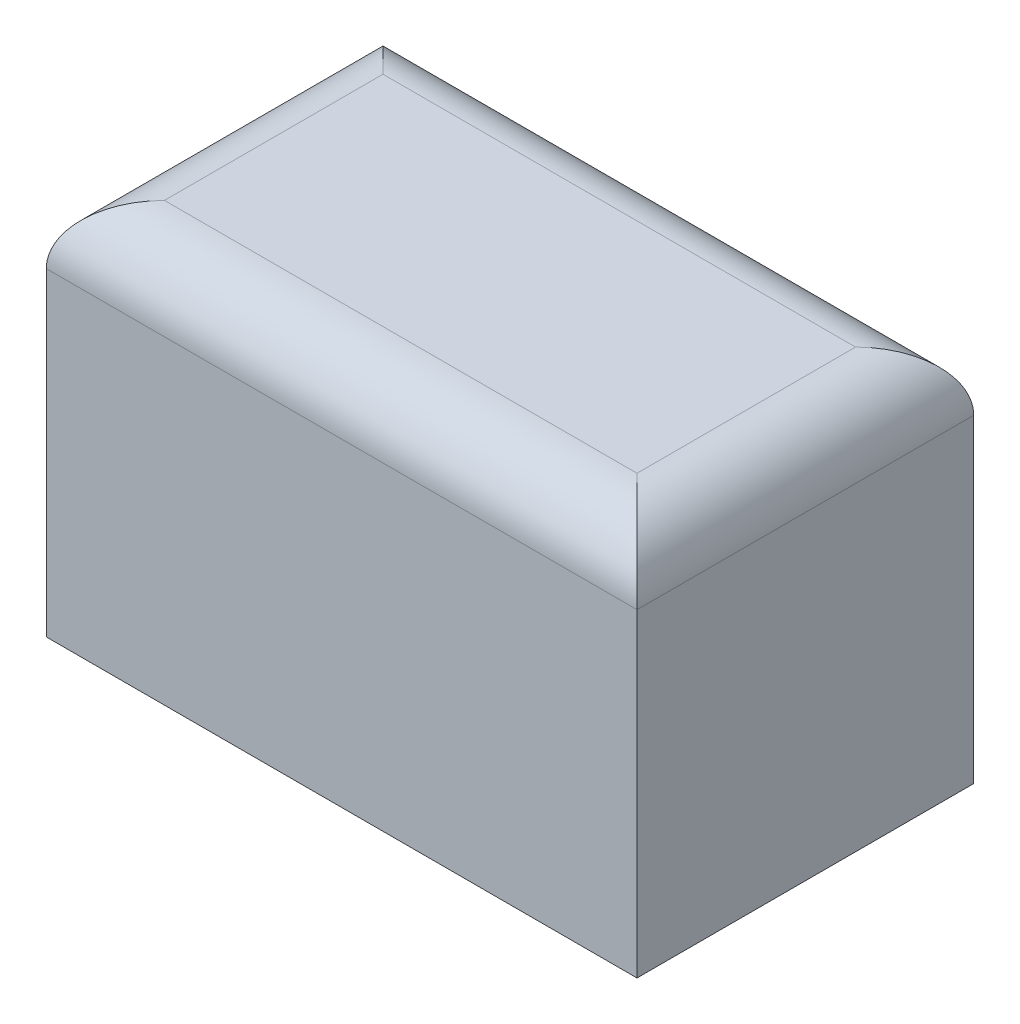
ISO-10303-21;
HEADER;
FILE_DESCRIPTION(('STEP AP214'),'2;1');
FILE_NAME('part.step','',(''),(''),'','','');
FILE_SCHEMA(('AUTOMOTIVE_DESIGN { 1 0 10303 214 1 1 1 1 }'));
ENDSEC;
DATA;
#1=APPLICATION_CONTEXT('core data for automotive mechanical design processes');
#2=APPLICATION_PROTOCOL_DEFINITION('international standard','automotive_design',2000,#1);
#3=PRODUCT_CONTEXT('',#1,'mechanical');
#4=PRODUCT('Part','Part','',(#3));
#5=PRODUCT_RELATED_PRODUCT_CATEGORY('part','',(#4));
#6=PRODUCT_DEFINITION_FORMATION('','',#4);
#7=PRODUCT_DEFINITION_CONTEXT('part definition',#1,'design');
#8=PRODUCT_DEFINITION('design','',#6,#7);
#9=PRODUCT_DEFINITION_SHAPE('','',#8);
#10=(LENGTH_UNIT() NAMED_UNIT(*) SI_UNIT(.MILLI.,.METRE.));
#11=(NAMED_UNIT(*) PLANE_ANGLE_UNIT() SI_UNIT($,.RADIAN.));
#12=(NAMED_UNIT(*) SI_UNIT($,.STERADIAN.) SOLID_ANGLE_UNIT());
#13=UNCERTAINTY_MEASURE_WITH_UNIT(LENGTH_MEASURE(1.E-05),#10,'distance_accuracy_value','');
#14=(GEOMETRIC_REPRESENTATION_CONTEXT(3) GLOBAL_UNCERTAINTY_ASSIGNED_CONTEXT((#13)) GLOBAL_UNIT_ASSIGNED_CONTEXT((#10,
#11,#12)) REPRESENTATION_CONTEXT('',''));
#15=CARTESIAN_POINT('',(0.,0.,0.));
#16=DIRECTION('',(0.,0.,1.));
#17=DIRECTION('',(1.,0.,0.));
#18=AXIS2_PLACEMENT_3D('',#15,#16,#17);
#19=CARTESIAN_POINT('',(5.00000000000002,6.4,2.85000000000001));
#20=DIRECTION('',(-1.,0.,0.));
#21=DIRECTION('',(0.,0.,1.));
#22=AXIS2_PLACEMENT_3D('',#19,#20,#21);
#23=PLANE('',#22);
#24=DIRECTION('',(0.,-1.,0.));
#25=VECTOR('',#24,1.);
#26=CARTESIAN_POINT('',(5.00000000000002,6.4,-2.85000000000001));
#27=LINE('',#26,#25);
#28=CARTESIAN_POINT('',(5.00000000000002,5.4,-2.85000000000001));
#29=VERTEX_POINT('',#28);
#30=CARTESIAN_POINT('',(5.00000000000002,0.,-2.85000000000001));
#31=VERTEX_POINT('',#30);
#32=EDGE_CURVE('E84',#29,#31,#27,.T.);
#33=ORIENTED_EDGE('',*,*,#32,.F.);
#34=DIRECTION('',(0.,0.,-1.));
#35=VECTOR('',#34,1.);
#36=CARTESIAN_POINT('',(5.00000000000002,5.4,2.85000000000001));
#37=LINE('',#36,#35);
#38=CARTESIAN_POINT('',(5.00000000000002,5.4,2.85000000000001));
#39=VERTEX_POINT('',#38);
#40=EDGE_CURVE('E41',#29,#39,#37,.F.);
#41=ORIENTED_EDGE('',*,*,#40,.T.);
#42=DIRECTION('',(0.,-1.,0.));
#43=VECTOR('',#42,1.);
#44=CARTESIAN_POINT('',(5.00000000000002,6.4,2.85000000000001));
#45=LINE('',#44,#43);
#46=CARTESIAN_POINT('',(5.00000000000002,0.,2.85000000000001));
#47=VERTEX_POINT('',#46);
#48=EDGE_CURVE('E101',#39,#47,#45,.T.);
#49=ORIENTED_EDGE('',*,*,#48,.T.);
#50=DIRECTION('',(0.,0.,-1.));
#51=VECTOR('',#50,1.);
#52=CARTESIAN_POINT('',(5.00000000000002,0.,2.85000000000001));
#53=LINE('',#52,#51);
#54=EDGE_CURVE('E97',#47,#31,#53,.T.);
#55=ORIENTED_EDGE('',*,*,#54,.T.);
#56=EDGE_LOOP('',(#33,#41,#49,#55));
#57=FACE_BOUND('',#56,.T.);
#58=ADVANCED_FACE('F32',(#57),#23,.F.);
#59=CARTESIAN_POINT('',(-5.,6.4,-2.85000000000001));
#60=DIRECTION('',(0.,0.,1.));
#61=DIRECTION('',(1.,0.,0.));
#62=AXIS2_PLACEMENT_3D('',#59,#60,#61);
#63=PLANE('',#62);
#64=DIRECTION('',(0.,-1.,0.));
#65=VECTOR('',#64,1.);
#66=CARTESIAN_POINT('',(-5.,6.4,-2.85000000000001));
#67=LINE('',#66,#65);
#68=CARTESIAN_POINT('',(-5.,5.4,-2.85000000000001));
#69=VERTEX_POINT('',#68);
#70=CARTESIAN_POINT('',(-5.,0.,-2.85000000000001));
#71=VERTEX_POINT('',#70);
#72=EDGE_CURVE('E91',#69,#71,#67,.T.);
#73=ORIENTED_EDGE('',*,*,#72,.F.);
#74=DIRECTION('',(-1.,0.,0.));
#75=VECTOR('',#74,1.);
#76=CARTESIAN_POINT('',(-5.,5.4,-2.85000000000001));
#77=LINE('',#76,#75);
#78=EDGE_CURVE('E56',#69,#29,#77,.F.);
#79=ORIENTED_EDGE('',*,*,#78,.T.);
#80=ORIENTED_EDGE('',*,*,#32,.T.);
#81=DIRECTION('',(-1.,0.,0.));
#82=VECTOR('',#81,1.);
#83=CARTESIAN_POINT('',(-5.,0.,-2.85000000000001));
#84=LINE('',#83,#82);
#85=EDGE_CURVE('E87',#31,#71,#84,.T.);
#86=ORIENTED_EDGE('',*,*,#85,.T.);
#87=EDGE_LOOP('',(#73,#79,#80,#86));
#88=FACE_BOUND('',#87,.T.);
#89=ADVANCED_FACE('F86',(#88),#63,.F.);
#90=CARTESIAN_POINT('',(-5.00000000000002,6.4,2.85000000000001));
#91=DIRECTION('',(1.,0.,0.));
#92=DIRECTION('',(0.,0.,-1.));
#93=AXIS2_PLACEMENT_3D('',#90,#91,#92);
#94=PLANE('',#93);
#95=DIRECTION('',(0.,-1.,0.));
#96=VECTOR('',#95,1.);
#97=CARTESIAN_POINT('',(-5.00000000000002,6.4,2.85000000000001));
#98=LINE('',#97,#96);
#99=CARTESIAN_POINT('',(-5.00000000000002,5.4,2.85000000000001));
#100=VERTEX_POINT('',#99);
#101=CARTESIAN_POINT('',(-5.00000000000002,0.,2.85000000000001));
#102=VERTEX_POINT('',#101);
#103=EDGE_CURVE('E111',#100,#102,#98,.T.);
#104=ORIENTED_EDGE('',*,*,#103,.F.);
#105=DIRECTION('',(0.,0.,1.));
#106=VECTOR('',#105,1.);
#107=CARTESIAN_POINT('',(-5.00000000000002,5.4,2.85000000000001));
#108=LINE('',#107,#106);
#109=EDGE_CURVE('E122',#100,#69,#108,.F.);
#110=ORIENTED_EDGE('',*,*,#109,.T.);
#111=ORIENTED_EDGE('',*,*,#72,.T.);
#112=DIRECTION('',(0.,0.,1.));
#113=VECTOR('',#112,1.);
#114=CARTESIAN_POINT('',(-5.00000000000002,0.,2.85000000000001));
#115=LINE('',#114,#113);
#116=EDGE_CURVE('E99',#71,#102,#115,.T.);
#117=ORIENTED_EDGE('',*,*,#116,.T.);
#118=EDGE_LOOP('',(#104,#110,#111,#117));
#119=FACE_BOUND('',#118,.T.);
#120=ADVANCED_FACE('F150',(#119),#94,.F.);
#121=CARTESIAN_POINT('',(-5.00000000000002,6.4,2.85000000000001));
#122=DIRECTION('',(0.,0.,-1.));
#123=DIRECTION('',(-1.,0.,0.));
#124=AXIS2_PLACEMENT_3D('',#121,#122,#123);
#125=PLANE('',#124);
#126=ORIENTED_EDGE('',*,*,#48,.F.);
#127=DIRECTION('',(1.,0.,0.));
#128=VECTOR('',#127,1.);
#129=CARTESIAN_POINT('',(-5.00000000000002,5.4,2.85000000000001));
#130=LINE('',#129,#128);
#131=EDGE_CURVE('E11',#39,#100,#130,.F.);
#132=ORIENTED_EDGE('',*,*,#131,.T.);
#133=ORIENTED_EDGE('',*,*,#103,.T.);
#134=DIRECTION('',(1.,0.,0.));
#135=VECTOR('',#134,1.);
#136=CARTESIAN_POINT('',(-5.00000000000002,0.,2.85000000000001));
#137=LINE('',#136,#135);
#138=EDGE_CURVE('E108',#102,#47,#137,.T.);
#139=ORIENTED_EDGE('',*,*,#138,.T.);
#140=EDGE_LOOP('',(#126,#132,#133,#139));
#141=FACE_BOUND('',#140,.T.);
#142=ADVANCED_FACE('F152',(#141),#125,.F.);
#143=CARTESIAN_POINT('',(0.,6.4,0.));
#144=DIRECTION('',(0.,-1.,0.));
#145=DIRECTION('',(0.,0.,-1.));
#146=AXIS2_PLACEMENT_3D('',#143,#144,#145);
#147=PLANE('',#146);
#148=DIRECTION('',(-1.,0.,0.));
#149=VECTOR('',#148,1.);
#150=CARTESIAN_POINT('',(0.,6.4,-1.85));
#151=LINE('',#150,#149);
#152=CARTESIAN_POINT('',(4.00000000000001,6.4,-1.85));
#153=VERTEX_POINT('',#152);
#154=CARTESIAN_POINT('',(-4.,6.4,-1.85));
#155=VERTEX_POINT('',#154);
#156=EDGE_CURVE('E117',#153,#155,#151,.T.);
#157=ORIENTED_EDGE('',*,*,#156,.T.);
#158=DIRECTION('',(0.,0.,1.));
#159=VECTOR('',#158,1.);
#160=CARTESIAN_POINT('',(-4.,6.4,0.));
#161=LINE('',#160,#159);
#162=CARTESIAN_POINT('',(-4.,6.4,1.85));
#163=VERTEX_POINT('',#162);
#164=EDGE_CURVE('E119',#155,#163,#161,.T.);
#165=ORIENTED_EDGE('',*,*,#164,.T.);
#166=DIRECTION('',(1.,0.,0.));
#167=VECTOR('',#166,1.);
#168=CARTESIAN_POINT('',(0.,6.4,1.85));
#169=LINE('',#168,#167);
#170=CARTESIAN_POINT('',(4.00000000000001,6.4,1.85));
#171=VERTEX_POINT('',#170);
#172=EDGE_CURVE('E90',#163,#171,#169,.T.);
#173=ORIENTED_EDGE('',*,*,#172,.T.);
#174=DIRECTION('',(0.,0.,-1.));
#175=VECTOR('',#174,1.);
#176=CARTESIAN_POINT('',(4.00000000000001,6.4,0.));
#177=LINE('',#176,#175);
#178=EDGE_CURVE('E115',#171,#153,#177,.T.);
#179=ORIENTED_EDGE('',*,*,#178,.T.);
#180=EDGE_LOOP('',(#157,#165,#173,#179));
#181=FACE_BOUND('',#180,.T.);
#182=ADVANCED_FACE('F142',(#181),#147,.F.);
#183=CARTESIAN_POINT('',(0.,0.,0.));
#184=DIRECTION('',(0.,-1.,0.));
#185=DIRECTION('',(0.,0.,-1.));
#186=AXIS2_PLACEMENT_3D('',#183,#184,#185);
#187=PLANE('',#186);
#188=ORIENTED_EDGE('',*,*,#54,.F.);
#189=ORIENTED_EDGE('',*,*,#138,.F.);
#190=ORIENTED_EDGE('',*,*,#116,.F.);
#191=ORIENTED_EDGE('',*,*,#85,.F.);
#192=EDGE_LOOP('',(#188,#189,#190,#191));
#193=FACE_BOUND('',#192,.T.);
#194=ADVANCED_FACE('F95',(#193),#187,.T.);
#195=CARTESIAN_POINT('',(4.00000000000001,5.4,0.));
#196=DIRECTION('',(0.,0.,-1.));
#197=DIRECTION('',(-1.,0.,0.));
#198=AXIS2_PLACEMENT_3D('',#195,#196,#197);
#199=CYLINDRICAL_SURFACE('',#198,1.);
#200=CARTESIAN_POINT('',(4.00000000000001,5.4,1.85));
#201=DIRECTION('',(0.707106781186549,0.,-0.707106781186549));
#202=DIRECTION('',(0.707106781186549,0.,0.707106781186549));
#203=AXIS2_PLACEMENT_3D('',#200,#201,#202);
#204=ELLIPSE('',#203,1.41421356237309,1.);
#205=EDGE_CURVE('E105',#39,#171,#204,.F.);
#206=ORIENTED_EDGE('',*,*,#205,.F.);
#207=ORIENTED_EDGE('',*,*,#40,.F.);
#208=CARTESIAN_POINT('',(4.00000000000001,5.4,-1.85));
#209=DIRECTION('',(-0.707106781186549,0.,-0.707106781186549));
#210=DIRECTION('',(0.707106781186549,0.,-0.707106781186549));
#211=AXIS2_PLACEMENT_3D('',#208,#209,#210);
#212=ELLIPSE('',#211,1.41421356237309,1.);
#213=EDGE_CURVE('E36',#153,#29,#212,.T.);
#214=ORIENTED_EDGE('',*,*,#213,.F.);
#215=ORIENTED_EDGE('',*,*,#178,.F.);
#216=EDGE_LOOP('',(#206,#207,#214,#215));
#217=FACE_BOUND('',#216,.T.);
#218=ADVANCED_FACE('F34',(#217),#199,.T.);
#219=CARTESIAN_POINT('',(0.,5.4,-1.85));
#220=DIRECTION('',(-1.,0.,0.));
#221=DIRECTION('',(0.,0.,1.));
#222=AXIS2_PLACEMENT_3D('',#219,#220,#221);
#223=CYLINDRICAL_SURFACE('',#222,1.);
#224=ORIENTED_EDGE('',*,*,#213,.T.);
#225=ORIENTED_EDGE('',*,*,#78,.F.);
#226=CARTESIAN_POINT('',(-4.,5.4,-1.85));
#227=DIRECTION('',(-0.707106781186549,0.,0.707106781186549));
#228=DIRECTION('',(-0.707106781186549,0.,-0.707106781186549));
#229=AXIS2_PLACEMENT_3D('',#226,#227,#228);
#230=ELLIPSE('',#229,1.41421356237309,1.);
#231=EDGE_CURVE('E129',#155,#69,#230,.T.);
#232=ORIENTED_EDGE('',*,*,#231,.F.);
#233=ORIENTED_EDGE('',*,*,#156,.F.);
#234=EDGE_LOOP('',(#224,#225,#232,#233));
#235=FACE_BOUND('',#234,.T.);
#236=ADVANCED_FACE('F172',(#235),#223,.T.);
#237=CARTESIAN_POINT('',(0.,5.4,1.85));
#238=DIRECTION('',(1.,0.,0.));
#239=DIRECTION('',(0.,0.,-1.));
#240=AXIS2_PLACEMENT_3D('',#237,#238,#239);
#241=CYLINDRICAL_SURFACE('',#240,1.);
#242=ORIENTED_EDGE('',*,*,#205,.T.);
#243=ORIENTED_EDGE('',*,*,#172,.F.);
#244=CARTESIAN_POINT('',(-4.,5.4,1.85));
#245=DIRECTION('',(0.707106781186549,0.,0.707106781186549));
#246=DIRECTION('',(0.707106781186549,0.,-0.707106781186549));
#247=AXIS2_PLACEMENT_3D('',#244,#245,#246);
#248=ELLIPSE('',#247,1.41421356237309,1.);
#249=EDGE_CURVE('E127',#100,#163,#248,.F.);
#250=ORIENTED_EDGE('',*,*,#249,.F.);
#251=ORIENTED_EDGE('',*,*,#131,.F.);
#252=EDGE_LOOP('',(#242,#243,#250,#251));
#253=FACE_BOUND('',#252,.T.);
#254=ADVANCED_FACE('F135',(#253),#241,.T.);
#255=CARTESIAN_POINT('',(-4.,5.4,0.));
#256=DIRECTION('',(0.,0.,1.));
#257=DIRECTION('',(1.,0.,0.));
#258=AXIS2_PLACEMENT_3D('',#255,#256,#257);
#259=CYLINDRICAL_SURFACE('',#258,1.);
#260=ORIENTED_EDGE('',*,*,#231,.T.);
#261=ORIENTED_EDGE('',*,*,#109,.F.);
#262=ORIENTED_EDGE('',*,*,#249,.T.);
#263=ORIENTED_EDGE('',*,*,#164,.F.);
#264=EDGE_LOOP('',(#260,#261,#262,#263));
#265=FACE_BOUND('',#264,.T.);
#266=ADVANCED_FACE('F146',(#265),#259,.T.);
#267=CLOSED_SHELL('',(#58,#89,#120,#142,#182,#194,#218,#236,#254,#266));
#268=MANIFOLD_SOLID_BREP('B2',#267);
#269=ADVANCED_BREP_SHAPE_REPRESENTATION('',(#18,#268),#14);
#270=SHAPE_DEFINITION_REPRESENTATION(#9,#269);
ENDSEC;
END-ISO-10303-21;
